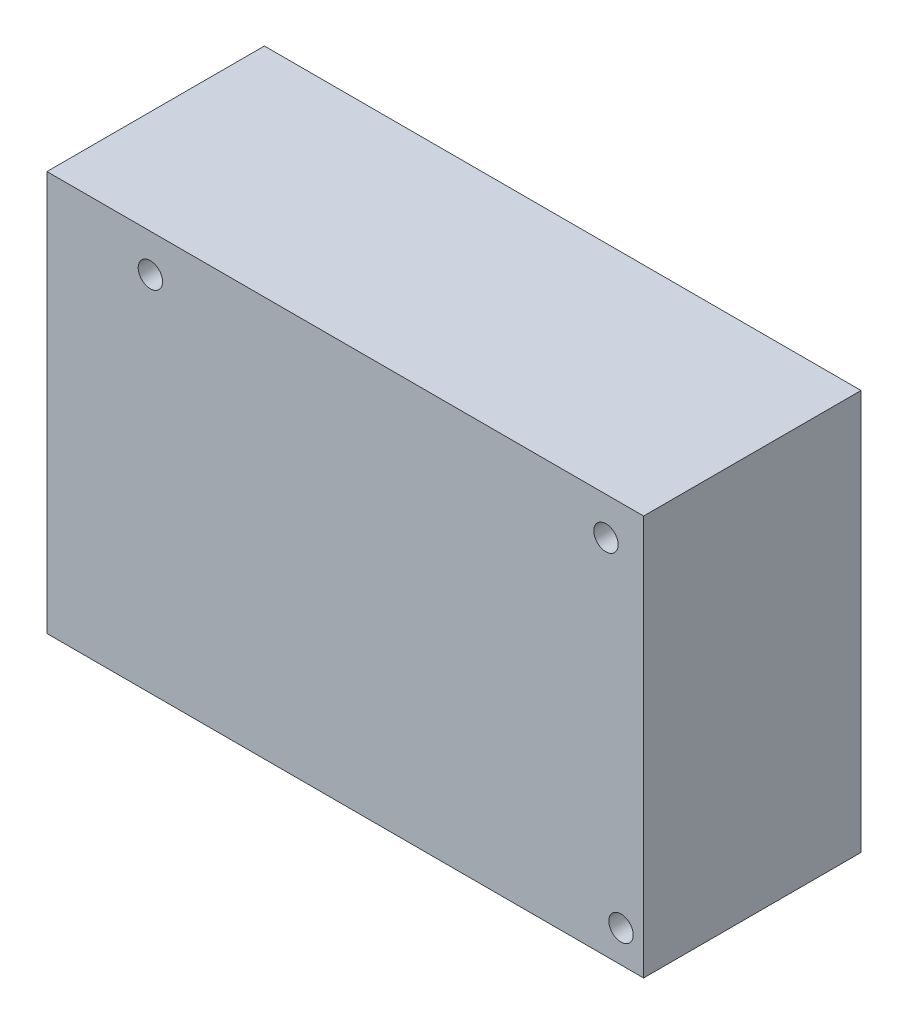
ISO-10303-21;
HEADER;
FILE_DESCRIPTION(('STEP AP214'),'2;1');
FILE_NAME('part.step','',(''),(''),'','','');
FILE_SCHEMA(('AUTOMOTIVE_DESIGN { 1 0 10303 214 1 1 1 1 }'));
ENDSEC;
DATA;
#1=APPLICATION_CONTEXT('core data for automotive mechanical design processes');
#2=APPLICATION_PROTOCOL_DEFINITION('international standard','automotive_design',2000,#1);
#3=PRODUCT_CONTEXT('',#1,'mechanical');
#4=PRODUCT('Part','Part','',(#3));
#5=PRODUCT_RELATED_PRODUCT_CATEGORY('part','',(#4));
#6=PRODUCT_DEFINITION_FORMATION('','',#4);
#7=PRODUCT_DEFINITION_CONTEXT('part definition',#1,'design');
#8=PRODUCT_DEFINITION('design','',#6,#7);
#9=PRODUCT_DEFINITION_SHAPE('','',#8);
#10=(LENGTH_UNIT() NAMED_UNIT(*) SI_UNIT(.MILLI.,.METRE.));
#11=(NAMED_UNIT(*) PLANE_ANGLE_UNIT() SI_UNIT($,.RADIAN.));
#12=(NAMED_UNIT(*) SI_UNIT($,.STERADIAN.) SOLID_ANGLE_UNIT());
#13=UNCERTAINTY_MEASURE_WITH_UNIT(LENGTH_MEASURE(1.E-05),#10,'distance_accuracy_value','');
#14=(GEOMETRIC_REPRESENTATION_CONTEXT(3) GLOBAL_UNCERTAINTY_ASSIGNED_CONTEXT((#13)) GLOBAL_UNIT_ASSIGNED_CONTEXT((#10,
#11,#12)) REPRESENTATION_CONTEXT('',''));
#15=CARTESIAN_POINT('',(0.,0.,0.));
#16=DIRECTION('',(0.,0.,1.));
#17=DIRECTION('',(1.,0.,0.));
#18=AXIS2_PLACEMENT_3D('',#15,#16,#17);
#19=CARTESIAN_POINT('',(-43.561,-29.21,31.75));
#20=DIRECTION('',(1.,0.,0.));
#21=DIRECTION('',(0.,0.,-1.));
#22=AXIS2_PLACEMENT_3D('',#19,#20,#21);
#23=PLANE('',#22);
#24=DIRECTION('',(0.,-1.,0.));
#25=VECTOR('',#24,1.);
#26=CARTESIAN_POINT('',(-43.561,-29.21,0.));
#27=LINE('',#26,#25);
#28=CARTESIAN_POINT('',(-43.561,29.21,0.));
#29=VERTEX_POINT('',#28);
#30=CARTESIAN_POINT('',(-43.561,-29.21,0.));
#31=VERTEX_POINT('',#30);
#32=EDGE_CURVE('E96',#29,#31,#27,.T.);
#33=ORIENTED_EDGE('',*,*,#32,.T.);
#34=DIRECTION('',(0.,0.,-1.));
#35=VECTOR('',#34,1.);
#36=CARTESIAN_POINT('',(-43.561,-29.21,31.75));
#37=LINE('',#36,#35);
#38=CARTESIAN_POINT('',(-43.561,-29.21,31.75));
#39=VERTEX_POINT('',#38);
#40=EDGE_CURVE('E11',#39,#31,#37,.T.);
#41=ORIENTED_EDGE('',*,*,#40,.F.);
#42=DIRECTION('',(0.,-1.,0.));
#43=VECTOR('',#42,1.);
#44=CARTESIAN_POINT('',(-43.561,-29.21,31.75));
#45=LINE('',#44,#43);
#46=CARTESIAN_POINT('',(-43.561,29.21,31.75));
#47=VERTEX_POINT('',#46);
#48=EDGE_CURVE('E84',#47,#39,#45,.T.);
#49=ORIENTED_EDGE('',*,*,#48,.F.);
#50=DIRECTION('',(0.,0.,-1.));
#51=VECTOR('',#50,1.);
#52=CARTESIAN_POINT('',(-43.561,29.21,31.75));
#53=LINE('',#52,#51);
#54=EDGE_CURVE('E92',#47,#29,#53,.T.);
#55=ORIENTED_EDGE('',*,*,#54,.T.);
#56=EDGE_LOOP('',(#33,#41,#49,#55));
#57=FACE_BOUND('',#56,.T.);
#58=ADVANCED_FACE('F33',(#57),#23,.F.);
#59=CARTESIAN_POINT('',(43.561,-29.21,31.75));
#60=DIRECTION('',(0.,1.,0.));
#61=DIRECTION('',(-1.,0.,0.));
#62=AXIS2_PLACEMENT_3D('',#59,#60,#61);
#63=PLANE('',#62);
#64=DIRECTION('',(1.,0.,0.));
#65=VECTOR('',#64,1.);
#66=CARTESIAN_POINT('',(43.561,-29.21,0.));
#67=LINE('',#66,#65);
#68=CARTESIAN_POINT('',(43.561,-29.21,0.));
#69=VERTEX_POINT('',#68);
#70=EDGE_CURVE('E88',#31,#69,#67,.T.);
#71=ORIENTED_EDGE('',*,*,#70,.T.);
#72=DIRECTION('',(0.,0.,-1.));
#73=VECTOR('',#72,1.);
#74=CARTESIAN_POINT('',(43.561,-29.21,31.75));
#75=LINE('',#74,#73);
#76=CARTESIAN_POINT('',(43.561,-29.21,31.75));
#77=VERTEX_POINT('',#76);
#78=EDGE_CURVE('E41',#77,#69,#75,.T.);
#79=ORIENTED_EDGE('',*,*,#78,.F.);
#80=DIRECTION('',(1.,0.,0.));
#81=VECTOR('',#80,1.);
#82=CARTESIAN_POINT('',(43.561,-29.21,31.75));
#83=LINE('',#82,#81);
#84=EDGE_CURVE('E79',#39,#77,#83,.T.);
#85=ORIENTED_EDGE('',*,*,#84,.F.);
#86=ORIENTED_EDGE('',*,*,#40,.T.);
#87=EDGE_LOOP('',(#71,#79,#85,#86));
#88=FACE_BOUND('',#87,.T.);
#89=ADVANCED_FACE('F87',(#88),#63,.F.);
#90=CARTESIAN_POINT('',(43.561,-29.21,31.75));
#91=DIRECTION('',(-1.,0.,0.));
#92=DIRECTION('',(0.,0.,1.));
#93=AXIS2_PLACEMENT_3D('',#90,#91,#92);
#94=PLANE('',#93);
#95=DIRECTION('',(0.,1.,0.));
#96=VECTOR('',#95,1.);
#97=CARTESIAN_POINT('',(43.561,-29.21,0.));
#98=LINE('',#97,#96);
#99=CARTESIAN_POINT('',(43.561,29.21,0.));
#100=VERTEX_POINT('',#99);
#101=EDGE_CURVE('E66',#69,#100,#98,.T.);
#102=ORIENTED_EDGE('',*,*,#101,.T.);
#103=DIRECTION('',(0.,0.,-1.));
#104=VECTOR('',#103,1.);
#105=CARTESIAN_POINT('',(43.561,29.21,31.75));
#106=LINE('',#105,#104);
#107=CARTESIAN_POINT('',(43.561,29.21,31.75));
#108=VERTEX_POINT('',#107);
#109=EDGE_CURVE('E89',#108,#100,#106,.T.);
#110=ORIENTED_EDGE('',*,*,#109,.F.);
#111=DIRECTION('',(0.,1.,0.));
#112=VECTOR('',#111,1.);
#113=CARTESIAN_POINT('',(43.561,-29.21,31.75));
#114=LINE('',#113,#112);
#115=EDGE_CURVE('E82',#77,#108,#114,.T.);
#116=ORIENTED_EDGE('',*,*,#115,.F.);
#117=ORIENTED_EDGE('',*,*,#78,.T.);
#118=EDGE_LOOP('',(#102,#110,#116,#117));
#119=FACE_BOUND('',#118,.T.);
#120=ADVANCED_FACE('F90',(#119),#94,.F.);
#121=CARTESIAN_POINT('',(43.561,29.21,31.75));
#122=DIRECTION('',(0.,-1.,0.));
#123=DIRECTION('',(1.,0.,0.));
#124=AXIS2_PLACEMENT_3D('',#121,#122,#123);
#125=PLANE('',#124);
#126=DIRECTION('',(-1.,0.,0.));
#127=VECTOR('',#126,1.);
#128=CARTESIAN_POINT('',(43.561,29.21,0.));
#129=LINE('',#128,#127);
#130=EDGE_CURVE('E72',#100,#29,#129,.T.);
#131=ORIENTED_EDGE('',*,*,#130,.T.);
#132=ORIENTED_EDGE('',*,*,#54,.F.);
#133=DIRECTION('',(-1.,0.,0.));
#134=VECTOR('',#133,1.);
#135=CARTESIAN_POINT('',(43.561,29.21,31.75));
#136=LINE('',#135,#134);
#137=EDGE_CURVE('E49',#108,#47,#136,.T.);
#138=ORIENTED_EDGE('',*,*,#137,.F.);
#139=ORIENTED_EDGE('',*,*,#109,.T.);
#140=EDGE_LOOP('',(#131,#132,#138,#139));
#141=FACE_BOUND('',#140,.T.);
#142=ADVANCED_FACE('F104',(#141),#125,.F.);
#143=CARTESIAN_POINT('',(0.,0.,31.75));
#144=DIRECTION('',(0.,0.,1.));
#145=DIRECTION('',(1.,0.,0.));
#146=AXIS2_PLACEMENT_3D('',#143,#144,#145);
#147=PLANE('',#146);
#148=CARTESIAN_POINT('',(40.259,-24.5364,31.75));
#149=DIRECTION('',(0.,0.,1.));
#150=DIRECTION('',(1.,0.,0.));
#151=AXIS2_PLACEMENT_3D('',#148,#149,#150);
#152=CIRCLE('',#151,1.778);
#153=CARTESIAN_POINT('',(42.037,-24.5364,31.75));
#154=VERTEX_POINT('',#153);
#155=EDGE_CURVE('E122',#154,#154,#152,.T.);
#156=ORIENTED_EDGE('',*,*,#155,.F.);
#157=EDGE_LOOP('',(#156));
#158=FACE_BOUND('',#157,.T.);
#159=CARTESIAN_POINT('',(38.0619,23.7109,31.75));
#160=DIRECTION('',(0.,0.,1.));
#161=DIRECTION('',(1.,0.,0.));
#162=AXIS2_PLACEMENT_3D('',#159,#160,#161);
#163=CIRCLE('',#162,1.778);
#164=CARTESIAN_POINT('',(39.8399,23.7109,31.75));
#165=VERTEX_POINT('',#164);
#166=EDGE_CURVE('E116',#165,#165,#163,.T.);
#167=ORIENTED_EDGE('',*,*,#166,.F.);
#168=EDGE_LOOP('',(#167));
#169=FACE_BOUND('',#168,.T.);
#170=CARTESIAN_POINT('',(-28.4607,23.7109,31.75));
#171=DIRECTION('',(0.,0.,1.));
#172=DIRECTION('',(1.,0.,0.));
#173=AXIS2_PLACEMENT_3D('',#170,#171,#172);
#174=CIRCLE('',#173,1.778);
#175=CARTESIAN_POINT('',(-26.6827,23.7109,31.75));
#176=VERTEX_POINT('',#175);
#177=EDGE_CURVE('E110',#176,#176,#174,.T.);
#178=ORIENTED_EDGE('',*,*,#177,.F.);
#179=EDGE_LOOP('',(#178));
#180=FACE_BOUND('',#179,.T.);
#181=ORIENTED_EDGE('',*,*,#48,.T.);
#182=ORIENTED_EDGE('',*,*,#84,.T.);
#183=ORIENTED_EDGE('',*,*,#115,.T.);
#184=ORIENTED_EDGE('',*,*,#137,.T.);
#185=EDGE_LOOP('',(#181,#182,#183,#184));
#186=FACE_BOUND('',#185,.T.);
#187=ADVANCED_FACE('F80',(#158,#169,#180,#186),#147,.T.);
#188=CARTESIAN_POINT('',(0.,0.,0.));
#189=DIRECTION('',(0.,0.,1.));
#190=DIRECTION('',(1.,0.,0.));
#191=AXIS2_PLACEMENT_3D('',#188,#189,#190);
#192=PLANE('',#191);
#193=CARTESIAN_POINT('',(40.259,-24.5364,0.));
#194=DIRECTION('',(0.,0.,1.));
#195=DIRECTION('',(1.,0.,0.));
#196=AXIS2_PLACEMENT_3D('',#193,#194,#195);
#197=CIRCLE('',#196,1.778);
#198=CARTESIAN_POINT('',(42.037,-24.5364,0.));
#199=VERTEX_POINT('',#198);
#200=EDGE_CURVE('E119',#199,#199,#197,.T.);
#201=ORIENTED_EDGE('',*,*,#200,.T.);
#202=EDGE_LOOP('',(#201));
#203=FACE_BOUND('',#202,.T.);
#204=CARTESIAN_POINT('',(38.0619,23.7109,0.));
#205=DIRECTION('',(0.,0.,1.));
#206=DIRECTION('',(1.,0.,0.));
#207=AXIS2_PLACEMENT_3D('',#204,#205,#206);
#208=CIRCLE('',#207,1.778);
#209=CARTESIAN_POINT('',(39.8399,23.7109,0.));
#210=VERTEX_POINT('',#209);
#211=EDGE_CURVE('E113',#210,#210,#208,.T.);
#212=ORIENTED_EDGE('',*,*,#211,.T.);
#213=EDGE_LOOP('',(#212));
#214=FACE_BOUND('',#213,.T.);
#215=CARTESIAN_POINT('',(-28.4607,23.7109,0.));
#216=DIRECTION('',(0.,0.,1.));
#217=DIRECTION('',(1.,0.,0.));
#218=AXIS2_PLACEMENT_3D('',#215,#216,#217);
#219=CIRCLE('',#218,1.778);
#220=CARTESIAN_POINT('',(-26.6827,23.7109,0.));
#221=VERTEX_POINT('',#220);
#222=EDGE_CURVE('E99',#221,#221,#219,.T.);
#223=ORIENTED_EDGE('',*,*,#222,.T.);
#224=EDGE_LOOP('',(#223));
#225=FACE_BOUND('',#224,.T.);
#226=ORIENTED_EDGE('',*,*,#32,.F.);
#227=ORIENTED_EDGE('',*,*,#130,.F.);
#228=ORIENTED_EDGE('',*,*,#101,.F.);
#229=ORIENTED_EDGE('',*,*,#70,.F.);
#230=EDGE_LOOP('',(#226,#227,#228,#229));
#231=FACE_BOUND('',#230,.T.);
#232=ADVANCED_FACE('F107',(#203,#214,#225,#231),#192,.F.);
#233=CARTESIAN_POINT('',(-28.4607,23.7109,0.));
#234=DIRECTION('',(0.,0.,1.));
#235=DIRECTION('',(1.,0.,0.));
#236=AXIS2_PLACEMENT_3D('',#233,#234,#235);
#237=CYLINDRICAL_SURFACE('',#236,1.778);
#238=ORIENTED_EDGE('',*,*,#222,.F.);
#239=EDGE_LOOP('',(#238));
#240=FACE_BOUND('',#239,.T.);
#241=ORIENTED_EDGE('',*,*,#177,.T.);
#242=EDGE_LOOP('',(#241));
#243=FACE_BOUND('',#242,.T.);
#244=ADVANCED_FACE('F144',(#240,#243),#237,.F.);
#245=CARTESIAN_POINT('',(38.0619,23.7109,0.));
#246=DIRECTION('',(0.,0.,1.));
#247=DIRECTION('',(1.,0.,0.));
#248=AXIS2_PLACEMENT_3D('',#245,#246,#247);
#249=CYLINDRICAL_SURFACE('',#248,1.778);
#250=ORIENTED_EDGE('',*,*,#211,.F.);
#251=EDGE_LOOP('',(#250));
#252=FACE_BOUND('',#251,.T.);
#253=ORIENTED_EDGE('',*,*,#166,.T.);
#254=EDGE_LOOP('',(#253));
#255=FACE_BOUND('',#254,.T.);
#256=ADVANCED_FACE('F133',(#252,#255),#249,.F.);
#257=CARTESIAN_POINT('',(40.259,-24.5364,0.));
#258=DIRECTION('',(0.,0.,1.));
#259=DIRECTION('',(1.,0.,0.));
#260=AXIS2_PLACEMENT_3D('',#257,#258,#259);
#261=CYLINDRICAL_SURFACE('',#260,1.778);
#262=ORIENTED_EDGE('',*,*,#200,.F.);
#263=EDGE_LOOP('',(#262));
#264=FACE_BOUND('',#263,.T.);
#265=ORIENTED_EDGE('',*,*,#155,.T.);
#266=EDGE_LOOP('',(#265));
#267=FACE_BOUND('',#266,.T.);
#268=ADVANCED_FACE('F130',(#264,#267),#261,.F.);
#269=CLOSED_SHELL('',(#58,#89,#120,#142,#187,#232,#244,#256,#268));
#270=MANIFOLD_SOLID_BREP('B2',#269);
#271=ADVANCED_BREP_SHAPE_REPRESENTATION('',(#18,#270),#14);
#272=SHAPE_DEFINITION_REPRESENTATION(#9,#271);
ENDSEC;
END-ISO-10303-21;
